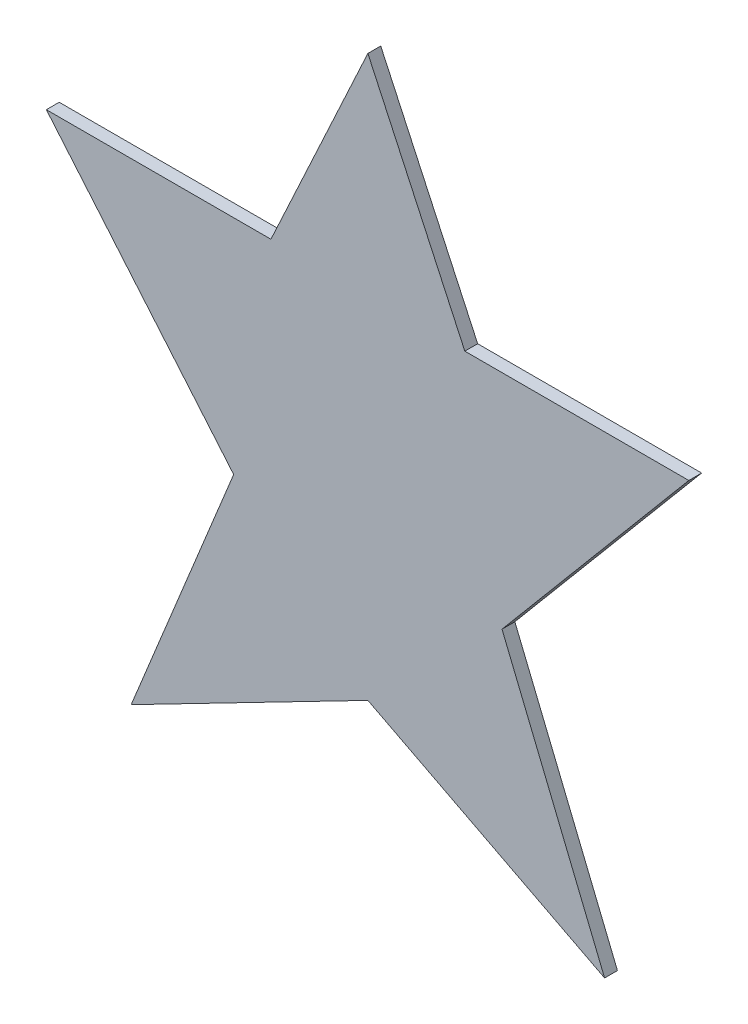
ISO-10303-21;
HEADER;
FILE_DESCRIPTION(('STEP AP214'),'2;1');
FILE_NAME('part.step','',(''),(''),'','','');
FILE_SCHEMA(('AUTOMOTIVE_DESIGN { 1 0 10303 214 1 1 1 1 }'));
ENDSEC;
DATA;
#1=APPLICATION_CONTEXT('core data for automotive mechanical design processes');
#2=APPLICATION_PROTOCOL_DEFINITION('international standard','automotive_design',2000,#1);
#3=PRODUCT_CONTEXT('',#1,'mechanical');
#4=PRODUCT('Part','Part','',(#3));
#5=PRODUCT_RELATED_PRODUCT_CATEGORY('part','',(#4));
#6=PRODUCT_DEFINITION_FORMATION('','',#4);
#7=PRODUCT_DEFINITION_CONTEXT('part definition',#1,'design');
#8=PRODUCT_DEFINITION('design','',#6,#7);
#9=PRODUCT_DEFINITION_SHAPE('','',#8);
#10=(LENGTH_UNIT() NAMED_UNIT(*) SI_UNIT(.MILLI.,.METRE.));
#11=(NAMED_UNIT(*) PLANE_ANGLE_UNIT() SI_UNIT($,.RADIAN.));
#12=(NAMED_UNIT(*) SI_UNIT($,.STERADIAN.) SOLID_ANGLE_UNIT());
#13=UNCERTAINTY_MEASURE_WITH_UNIT(LENGTH_MEASURE(1.E-05),#10,'distance_accuracy_value','');
#14=(GEOMETRIC_REPRESENTATION_CONTEXT(3) GLOBAL_UNCERTAINTY_ASSIGNED_CONTEXT((#13)) GLOBAL_UNIT_ASSIGNED_CONTEXT((#10,
#11,#12)) REPRESENTATION_CONTEXT('',''));
#15=CARTESIAN_POINT('',(0.,0.,0.));
#16=DIRECTION('',(0.,0.,1.));
#17=DIRECTION('',(1.,0.,0.));
#18=AXIS2_PLACEMENT_3D('',#15,#16,#17);
#19=CARTESIAN_POINT('',(9.81810132153856,-1.40270883551921,0.1));
#20=DIRECTION('',(-0.907445166383497,-0.420170524914858,0.));
#21=DIRECTION('',(0.420170524914858,-0.907445166383497,0.));
#22=AXIS2_PLACEMENT_3D('',#19,#20,#21);
#23=PLANE('',#22);
#24=DIRECTION('',(-0.420170524914858,0.907445166383497,0.));
#25=VECTOR('',#24,1.);
#26=CARTESIAN_POINT('',(9.81810132153856,-1.40270883551921,0.));
#27=LINE('',#26,#25);
#28=CARTESIAN_POINT('',(9.81810132153856,-1.40270883551921,0.));
#29=VERTEX_POINT('',#28);
#30=CARTESIAN_POINT('',(9.0632533712422,0.227541463427201,0.));
#31=VERTEX_POINT('',#30);
#32=EDGE_CURVE('E141',#29,#31,#27,.T.);
#33=ORIENTED_EDGE('',*,*,#32,.T.);
#34=DIRECTION('',(0.,0.,-1.));
#35=VECTOR('',#34,1.);
#36=CARTESIAN_POINT('',(9.0632533712422,0.227541463427201,0.1));
#37=LINE('',#36,#35);
#38=CARTESIAN_POINT('',(9.0632533712422,0.227541463427201,0.1));
#39=VERTEX_POINT('',#38);
#40=EDGE_CURVE('E11',#39,#31,#37,.T.);
#41=ORIENTED_EDGE('',*,*,#40,.F.);
#42=DIRECTION('',(-0.420170524914858,0.907445166383497,0.));
#43=VECTOR('',#42,1.);
#44=CARTESIAN_POINT('',(9.81810132153856,-1.40270883551921,0.1));
#45=LINE('',#44,#43);
#46=CARTESIAN_POINT('',(9.81810132153856,-1.40270883551921,0.1));
#47=VERTEX_POINT('',#46);
#48=EDGE_CURVE('E159',#47,#39,#45,.T.);
#49=ORIENTED_EDGE('',*,*,#48,.F.);
#50=DIRECTION('',(0.,0.,-1.));
#51=VECTOR('',#50,1.);
#52=CARTESIAN_POINT('',(9.81810132153856,-1.40270883551921,0.1));
#53=LINE('',#52,#51);
#54=EDGE_CURVE('E137',#47,#29,#53,.T.);
#55=ORIENTED_EDGE('',*,*,#54,.T.);
#56=EDGE_LOOP('',(#33,#41,#49,#55));
#57=FACE_BOUND('',#56,.T.);
#58=ADVANCED_FACE('F33',(#57),#23,.F.);
#59=CARTESIAN_POINT('',(9.0632533712422,0.227541463427201,0.1));
#60=DIRECTION('',(0.907452713350168,-0.420154225295211,0.));
#61=DIRECTION('',(0.420154225295211,0.907452713350168,0.));
#62=AXIS2_PLACEMENT_3D('',#59,#60,#61);
#63=PLANE('',#62);
#64=DIRECTION('',(-0.420154225295211,-0.907452713350168,0.));
#65=VECTOR('',#64,1.);
#66=CARTESIAN_POINT('',(9.0632533712422,0.227541463427201,0.));
#67=LINE('',#66,#65);
#68=CARTESIAN_POINT('',(8.30831970763487,-1.40297076326411,0.));
#69=VERTEX_POINT('',#68);
#70=EDGE_CURVE('E144',#31,#69,#67,.T.);
#71=ORIENTED_EDGE('',*,*,#70,.T.);
#72=DIRECTION('',(0.,0.,-1.));
#73=VECTOR('',#72,1.);
#74=CARTESIAN_POINT('',(8.30831970763487,-1.40297076326411,0.1));
#75=LINE('',#74,#73);
#76=CARTESIAN_POINT('',(8.30831970763487,-1.40297076326411,0.1));
#77=VERTEX_POINT('',#76);
#78=EDGE_CURVE('E41',#77,#69,#75,.T.);
#79=ORIENTED_EDGE('',*,*,#78,.F.);
#80=DIRECTION('',(-0.420154225295211,-0.907452713350168,0.));
#81=VECTOR('',#80,1.);
#82=CARTESIAN_POINT('',(9.0632533712422,0.227541463427201,0.1));
#83=LINE('',#82,#81);
#84=EDGE_CURVE('E98',#39,#77,#83,.T.);
#85=ORIENTED_EDGE('',*,*,#84,.F.);
#86=ORIENTED_EDGE('',*,*,#40,.T.);
#87=EDGE_LOOP('',(#71,#79,#85,#86));
#88=FACE_BOUND('',#87,.T.);
#89=ADVANCED_FACE('F208',(#88),#63,.F.);
#90=CARTESIAN_POINT('',(8.30831970763487,-1.40297076326411,0.1));
#91=DIRECTION('',(0.000348049515851125,-0.999999939430766,0.));
#92=DIRECTION('',(0.999999939430765,0.000348049515851124,0.));
#93=AXIS2_PLACEMENT_3D('',#90,#91,#92);
#94=PLANE('',#93);
#95=DIRECTION('',(-0.999999939430765,-0.000348049515851125,0.));
#96=VECTOR('',#95,1.);
#97=CARTESIAN_POINT('',(8.30831970763487,-1.40297076326411,0.));
#98=LINE('',#97,#96);
#99=CARTESIAN_POINT('',(6.55961660158488,-1.4035793985704,0.));
#100=VERTEX_POINT('',#99);
#101=EDGE_CURVE('E146',#69,#100,#98,.T.);
#102=ORIENTED_EDGE('',*,*,#101,.T.);
#103=DIRECTION('',(0.,0.,-1.));
#104=VECTOR('',#103,1.);
#105=CARTESIAN_POINT('',(6.55961660158488,-1.4035793985704,0.1));
#106=LINE('',#105,#104);
#107=CARTESIAN_POINT('',(6.55961660158488,-1.4035793985704,0.1));
#108=VERTEX_POINT('',#107);
#109=EDGE_CURVE('E172',#108,#100,#106,.T.);
#110=ORIENTED_EDGE('',*,*,#109,.F.);
#111=DIRECTION('',(-0.999999939430765,-0.000348049515851125,0.));
#112=VECTOR('',#111,1.);
#113=CARTESIAN_POINT('',(8.30831970763487,-1.40297076326411,0.1));
#114=LINE('',#113,#112);
#115=EDGE_CURVE('E180',#77,#108,#114,.T.);
#116=ORIENTED_EDGE('',*,*,#115,.F.);
#117=ORIENTED_EDGE('',*,*,#78,.T.);
#118=EDGE_LOOP('',(#102,#110,#116,#117));
#119=FACE_BOUND('',#118,.T.);
#120=ADVANCED_FACE('F178',(#119),#94,.F.);
#121=CARTESIAN_POINT('',(6.55961660158488,-1.4035793985704,0.1));
#122=DIRECTION('',(0.76471255617921,0.644371559290025,0.));
#123=DIRECTION('',(-0.644371559290025,0.76471255617921,0.));
#124=AXIS2_PLACEMENT_3D('',#121,#122,#123);
#125=PLANE('',#124);
#126=DIRECTION('',(0.644371559290026,-0.76471255617921,0.));
#127=VECTOR('',#126,1.);
#128=CARTESIAN_POINT('',(6.55961660158488,-1.4035793985704,0.));
#129=LINE('',#128,#127);
#130=CARTESIAN_POINT('',(8.01818055791674,-3.13454060459621,0.));
#131=VERTEX_POINT('',#130);
#132=EDGE_CURVE('E148',#100,#131,#129,.T.);
#133=ORIENTED_EDGE('',*,*,#132,.T.);
#134=DIRECTION('',(0.,0.,-1.));
#135=VECTOR('',#134,1.);
#136=CARTESIAN_POINT('',(8.01818055791674,-3.13454060459621,0.1));
#137=LINE('',#136,#135);
#138=CARTESIAN_POINT('',(8.01818055791674,-3.13454060459621,0.1));
#139=VERTEX_POINT('',#138);
#140=EDGE_CURVE('E169',#139,#131,#137,.T.);
#141=ORIENTED_EDGE('',*,*,#140,.F.);
#142=DIRECTION('',(0.644371559290026,-0.76471255617921,0.));
#143=VECTOR('',#142,1.);
#144=CARTESIAN_POINT('',(6.55961660158488,-1.4035793985704,0.1));
#145=LINE('',#144,#143);
#146=EDGE_CURVE('E198',#108,#139,#145,.T.);
#147=ORIENTED_EDGE('',*,*,#146,.F.);
#148=ORIENTED_EDGE('',*,*,#109,.T.);
#149=EDGE_LOOP('',(#133,#141,#147,#148));
#150=FACE_BOUND('',#149,.T.);
#151=ADVANCED_FACE('F189',(#150),#125,.F.);
#152=CARTESIAN_POINT('',(7.2200390620162,-5.08567445542721,0.1));
#153=DIRECTION('',(0.925555205561433,-0.378612680001786,0.));
#154=DIRECTION('',(0.378612680001786,0.925555205561433,0.));
#155=AXIS2_PLACEMENT_3D('',#152,#153,#154);
#156=PLANE('',#155);
#157=DIRECTION('',(-0.378612680001786,-0.925555205561433,0.));
#158=VECTOR('',#157,1.);
#159=CARTESIAN_POINT('',(7.2200390620162,-5.08567445542721,0.));
#160=LINE('',#159,#158);
#161=CARTESIAN_POINT('',(7.2200390620162,-5.08567445542721,0.));
#162=VERTEX_POINT('',#161);
#163=EDGE_CURVE('E150',#131,#162,#160,.T.);
#164=ORIENTED_EDGE('',*,*,#163,.T.);
#165=DIRECTION('',(0.,0.,-1.));
#166=VECTOR('',#165,1.);
#167=CARTESIAN_POINT('',(7.2200390620162,-5.08567445542721,0.1));
#168=LINE('',#167,#166);
#169=CARTESIAN_POINT('',(7.2200390620162,-5.08567445542721,0.1));
#170=VERTEX_POINT('',#169);
#171=EDGE_CURVE('E166',#170,#162,#168,.T.);
#172=ORIENTED_EDGE('',*,*,#171,.F.);
#173=DIRECTION('',(-0.378612680001786,-0.925555205561433,0.));
#174=VECTOR('',#173,1.);
#175=CARTESIAN_POINT('',(7.2200390620162,-5.08567445542721,0.1));
#176=LINE('',#175,#174);
#177=EDGE_CURVE('E195',#139,#170,#176,.T.);
#178=ORIENTED_EDGE('',*,*,#177,.F.);
#179=ORIENTED_EDGE('',*,*,#140,.T.);
#180=EDGE_LOOP('',(#164,#172,#178,#179));
#181=FACE_BOUND('',#180,.T.);
#182=ADVANCED_FACE('F193',(#181),#156,.F.);
#183=CARTESIAN_POINT('',(9.06329255328941,-4.1352238016762,0.1));
#184=DIRECTION('',(-0.45829792179167,0.888798635733335,0.));
#185=DIRECTION('',(-0.888798635733335,-0.45829792179167,0.));
#186=AXIS2_PLACEMENT_3D('',#183,#184,#185);
#187=PLANE('',#186);
#188=DIRECTION('',(0.888798635733334,0.45829792179167,0.));
#189=VECTOR('',#188,1.);
#190=CARTESIAN_POINT('',(9.06329255328941,-4.1352238016762,0.));
#191=LINE('',#190,#189);
#192=CARTESIAN_POINT('',(9.06329255328941,-4.1352238016762,0.));
#193=VERTEX_POINT('',#192);
#194=EDGE_CURVE('E152',#162,#193,#191,.T.);
#195=ORIENTED_EDGE('',*,*,#194,.T.);
#196=DIRECTION('',(0.,0.,-1.));
#197=VECTOR('',#196,1.);
#198=CARTESIAN_POINT('',(9.06329255328941,-4.1352238016762,0.1));
#199=LINE('',#198,#197);
#200=CARTESIAN_POINT('',(9.06329255328941,-4.1352238016762,0.1));
#201=VERTEX_POINT('',#200);
#202=EDGE_CURVE('E163',#201,#193,#199,.T.);
#203=ORIENTED_EDGE('',*,*,#202,.F.);
#204=DIRECTION('',(0.888798635733334,0.45829792179167,0.));
#205=VECTOR('',#204,1.);
#206=CARTESIAN_POINT('',(9.06329255328941,-4.1352238016762,0.1));
#207=LINE('',#206,#205);
#208=EDGE_CURVE('E197',#170,#201,#207,.T.);
#209=ORIENTED_EDGE('',*,*,#208,.F.);
#210=ORIENTED_EDGE('',*,*,#171,.T.);
#211=EDGE_LOOP('',(#195,#203,#209,#210));
#212=FACE_BOUND('',#211,.T.);
#213=ADVANCED_FACE('F220',(#212),#187,.F.);
#214=CARTESIAN_POINT('',(10.9065631162827,-5.0856413467103,0.1));
#215=DIRECTION('',(0.458281957095264,0.888806867548251,0.));
#216=DIRECTION('',(-0.888806867548251,0.458281957095264,0.));
#217=AXIS2_PLACEMENT_3D('',#214,#215,#216);
#218=PLANE('',#217);
#219=DIRECTION('',(0.888806867548251,-0.458281957095264,0.));
#220=VECTOR('',#219,1.);
#221=CARTESIAN_POINT('',(10.9065631162827,-5.0856413467103,0.));
#222=LINE('',#221,#220);
#223=CARTESIAN_POINT('',(10.9065631162827,-5.0856413467103,0.));
#224=VERTEX_POINT('',#223);
#225=EDGE_CURVE('E154',#193,#224,#222,.T.);
#226=ORIENTED_EDGE('',*,*,#225,.T.);
#227=DIRECTION('',(0.,0.,-1.));
#228=VECTOR('',#227,1.);
#229=CARTESIAN_POINT('',(10.9065631162827,-5.0856413467103,0.1));
#230=LINE('',#229,#228);
#231=CARTESIAN_POINT('',(10.9065631162827,-5.0856413467103,0.1));
#232=VERTEX_POINT('',#231);
#233=EDGE_CURVE('E132',#232,#224,#230,.T.);
#234=ORIENTED_EDGE('',*,*,#233,.F.);
#235=DIRECTION('',(0.888806867548251,-0.458281957095264,0.));
#236=VECTOR('',#235,1.);
#237=CARTESIAN_POINT('',(10.9065631162827,-5.0856413467103,0.1));
#238=LINE('',#237,#236);
#239=EDGE_CURVE('E123',#201,#232,#238,.T.);
#240=ORIENTED_EDGE('',*,*,#239,.F.);
#241=ORIENTED_EDGE('',*,*,#202,.T.);
#242=EDGE_LOOP('',(#226,#234,#240,#241));
#243=FACE_BOUND('',#242,.T.);
#244=ADVANCED_FACE('F223',(#243),#218,.F.);
#245=CARTESIAN_POINT('',(10.1076622938416,-3.1327513500094,0.1));
#246=DIRECTION('',(-0.925548404762073,-0.378629304785541,0.));
#247=DIRECTION('',(0.378629304785541,-0.925548404762073,0.));
#248=AXIS2_PLACEMENT_3D('',#245,#246,#247);
#249=PLANE('',#248);
#250=DIRECTION('',(-0.378629304785541,0.925548404762073,0.));
#251=VECTOR('',#250,1.);
#252=CARTESIAN_POINT('',(10.1076622938416,-3.1327513500094,0.));
#253=LINE('',#252,#251);
#254=CARTESIAN_POINT('',(10.1076622938416,-3.1327513500094,0.));
#255=VERTEX_POINT('',#254);
#256=EDGE_CURVE('E131',#224,#255,#253,.T.);
#257=ORIENTED_EDGE('',*,*,#256,.T.);
#258=DIRECTION('',(0.,0.,-1.));
#259=VECTOR('',#258,1.);
#260=CARTESIAN_POINT('',(10.1076622938416,-3.1327513500094,0.1));
#261=LINE('',#260,#259);
#262=CARTESIAN_POINT('',(10.1076622938416,-3.1327513500094,0.1));
#263=VERTEX_POINT('',#262);
#264=EDGE_CURVE('E128',#263,#255,#261,.T.);
#265=ORIENTED_EDGE('',*,*,#264,.F.);
#266=DIRECTION('',(-0.378629304785541,0.925548404762073,0.));
#267=VECTOR('',#266,1.);
#268=CARTESIAN_POINT('',(10.1076622938416,-3.1327513500094,0.1));
#269=LINE('',#268,#267);
#270=EDGE_CURVE('E117',#232,#263,#269,.T.);
#271=ORIENTED_EDGE('',*,*,#270,.F.);
#272=ORIENTED_EDGE('',*,*,#233,.T.);
#273=EDGE_LOOP('',(#257,#265,#271,#272));
#274=FACE_BOUND('',#273,.T.);
#275=ADVANCED_FACE('F129',(#274),#249,.F.);
#276=CARTESIAN_POINT('',(11.5621405824151,-1.40270883551921,0.1));
#277=DIRECTION('',(-0.765434042126366,0.643514356602937,0.));
#278=DIRECTION('',(-0.643514356602937,-0.765434042126366,0.));
#279=AXIS2_PLACEMENT_3D('',#276,#277,#278);
#280=PLANE('',#279);
#281=DIRECTION('',(0.643514356602937,0.765434042126366,0.));
#282=VECTOR('',#281,1.);
#283=CARTESIAN_POINT('',(11.5621405824151,-1.40270883551921,0.));
#284=LINE('',#283,#282);
#285=CARTESIAN_POINT('',(11.5621405824151,-1.40270883551921,0.));
#286=VERTEX_POINT('',#285);
#287=EDGE_CURVE('E84',#255,#286,#284,.T.);
#288=ORIENTED_EDGE('',*,*,#287,.T.);
#289=DIRECTION('',(0.,0.,-1.));
#290=VECTOR('',#289,1.);
#291=CARTESIAN_POINT('',(11.5621405824151,-1.40270883551921,0.1));
#292=LINE('',#291,#290);
#293=CARTESIAN_POINT('',(11.5621405824151,-1.40270883551921,0.1));
#294=VERTEX_POINT('',#293);
#295=EDGE_CURVE('E133',#294,#286,#292,.T.);
#296=ORIENTED_EDGE('',*,*,#295,.F.);
#297=DIRECTION('',(0.643514356602937,0.765434042126366,0.));
#298=VECTOR('',#297,1.);
#299=CARTESIAN_POINT('',(11.5621405824151,-1.40270883551921,0.1));
#300=LINE('',#299,#298);
#301=EDGE_CURVE('E121',#263,#294,#300,.T.);
#302=ORIENTED_EDGE('',*,*,#301,.F.);
#303=ORIENTED_EDGE('',*,*,#264,.T.);
#304=EDGE_LOOP('',(#288,#296,#302,#303));
#305=FACE_BOUND('',#304,.T.);
#306=ADVANCED_FACE('F135',(#305),#280,.F.);
#307=CARTESIAN_POINT('',(9.81810132153856,-1.40270883551921,0.1));
#308=DIRECTION('',(0.,-1.,0.));
#309=DIRECTION('',(0.,0.,-1.));
#310=AXIS2_PLACEMENT_3D('',#307,#308,#309);
#311=PLANE('',#310);
#312=DIRECTION('',(-1.,0.,0.));
#313=VECTOR('',#312,1.);
#314=CARTESIAN_POINT('',(9.81810132153856,-1.40270883551921,0.));
#315=LINE('',#314,#313);
#316=EDGE_CURVE('E90',#286,#29,#315,.T.);
#317=ORIENTED_EDGE('',*,*,#316,.T.);
#318=ORIENTED_EDGE('',*,*,#54,.F.);
#319=DIRECTION('',(-1.,0.,0.));
#320=VECTOR('',#319,1.);
#321=CARTESIAN_POINT('',(9.81810132153856,-1.40270883551921,0.1));
#322=LINE('',#321,#320);
#323=EDGE_CURVE('E49',#294,#47,#322,.T.);
#324=ORIENTED_EDGE('',*,*,#323,.F.);
#325=ORIENTED_EDGE('',*,*,#295,.T.);
#326=EDGE_LOOP('',(#317,#318,#324,#325));
#327=FACE_BOUND('',#326,.T.);
#328=ADVANCED_FACE('F232',(#327),#311,.F.);
#329=CARTESIAN_POINT('',(0.,0.,0.1));
#330=DIRECTION('',(0.,0.,1.));
#331=DIRECTION('',(1.,0.,0.));
#332=AXIS2_PLACEMENT_3D('',#329,#330,#331);
#333=PLANE('',#332);
#334=ORIENTED_EDGE('',*,*,#48,.T.);
#335=ORIENTED_EDGE('',*,*,#84,.T.);
#336=ORIENTED_EDGE('',*,*,#115,.T.);
#337=ORIENTED_EDGE('',*,*,#146,.T.);
#338=ORIENTED_EDGE('',*,*,#177,.T.);
#339=ORIENTED_EDGE('',*,*,#208,.T.);
#340=ORIENTED_EDGE('',*,*,#239,.T.);
#341=ORIENTED_EDGE('',*,*,#270,.T.);
#342=ORIENTED_EDGE('',*,*,#301,.T.);
#343=ORIENTED_EDGE('',*,*,#323,.T.);
#344=EDGE_LOOP('',(#334,#335,#336,#337,#338,#339,#340,#341,#342,#343));
#345=FACE_BOUND('',#344,.T.);
#346=ADVANCED_FACE('F119',(#345),#333,.T.);
#347=CARTESIAN_POINT('',(0.,0.,0.));
#348=DIRECTION('',(0.,0.,1.));
#349=DIRECTION('',(1.,0.,0.));
#350=AXIS2_PLACEMENT_3D('',#347,#348,#349);
#351=PLANE('',#350);
#352=ORIENTED_EDGE('',*,*,#32,.F.);
#353=ORIENTED_EDGE('',*,*,#316,.F.);
#354=ORIENTED_EDGE('',*,*,#287,.F.);
#355=ORIENTED_EDGE('',*,*,#256,.F.);
#356=ORIENTED_EDGE('',*,*,#225,.F.);
#357=ORIENTED_EDGE('',*,*,#194,.F.);
#358=ORIENTED_EDGE('',*,*,#163,.F.);
#359=ORIENTED_EDGE('',*,*,#132,.F.);
#360=ORIENTED_EDGE('',*,*,#101,.F.);
#361=ORIENTED_EDGE('',*,*,#70,.F.);
#362=EDGE_LOOP('',(#352,#353,#354,#355,#356,#357,#358,#359,#360,#361));
#363=FACE_BOUND('',#362,.T.);
#364=ADVANCED_FACE('F184',(#363),#351,.F.);
#365=CLOSED_SHELL('',(#58,#89,#120,#151,#182,#213,#244,#275,#306,#328,#346,#364));
#366=MANIFOLD_SOLID_BREP('B2',#365);
#367=ADVANCED_BREP_SHAPE_REPRESENTATION('',(#18,#366),#14);
#368=SHAPE_DEFINITION_REPRESENTATION(#9,#367);
ENDSEC;
END-ISO-10303-21;
